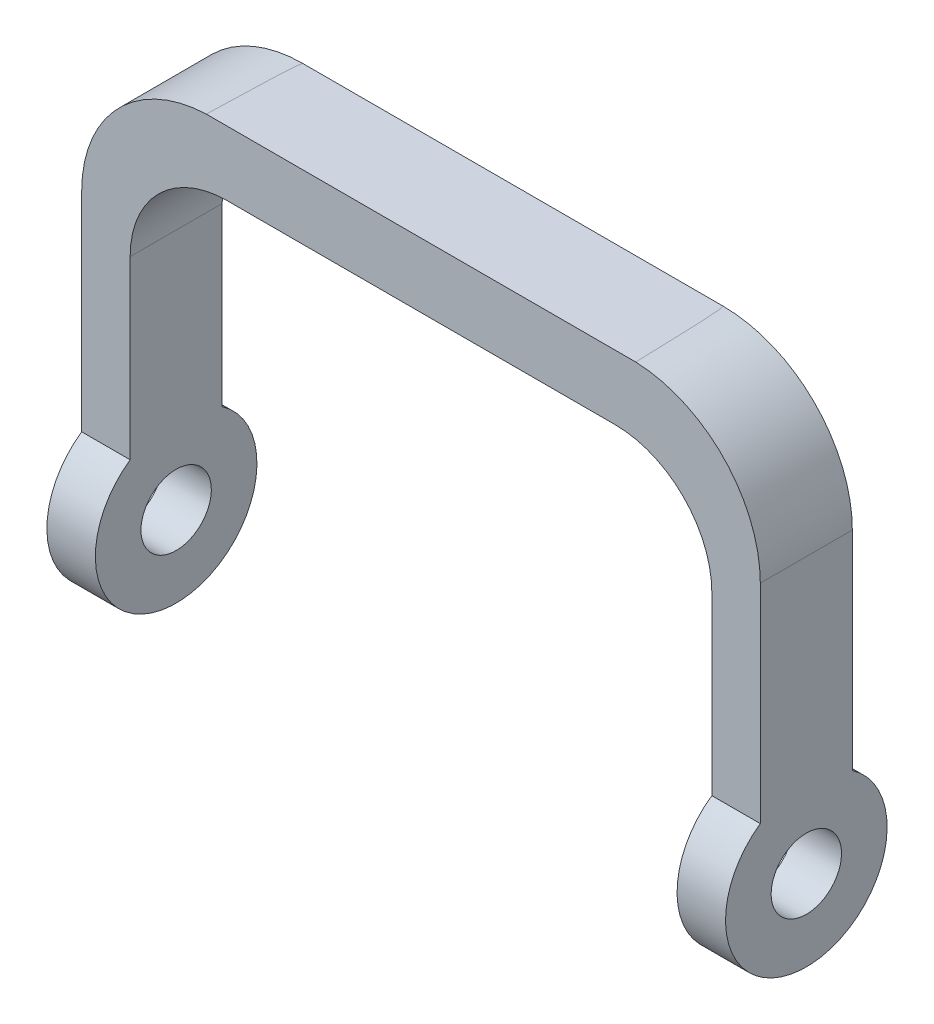
ISO-10303-21;
HEADER;
FILE_DESCRIPTION(('STEP AP214'),'2;1');
FILE_NAME('part.step','',(''),(''),'','','');
FILE_SCHEMA(('AUTOMOTIVE_DESIGN { 1 0 10303 214 1 1 1 1 }'));
ENDSEC;
DATA;
#1=APPLICATION_CONTEXT('core data for automotive mechanical design processes');
#2=APPLICATION_PROTOCOL_DEFINITION('international standard','automotive_design',2000,#1);
#3=PRODUCT_CONTEXT('',#1,'mechanical');
#4=PRODUCT('Part','Part','',(#3));
#5=PRODUCT_RELATED_PRODUCT_CATEGORY('part','',(#4));
#6=PRODUCT_DEFINITION_FORMATION('','',#4);
#7=PRODUCT_DEFINITION_CONTEXT('part definition',#1,'design');
#8=PRODUCT_DEFINITION('design','',#6,#7);
#9=PRODUCT_DEFINITION_SHAPE('','',#8);
#10=(LENGTH_UNIT() NAMED_UNIT(*) SI_UNIT(.MILLI.,.METRE.));
#11=(NAMED_UNIT(*) PLANE_ANGLE_UNIT() SI_UNIT($,.RADIAN.));
#12=(NAMED_UNIT(*) SI_UNIT($,.STERADIAN.) SOLID_ANGLE_UNIT());
#13=UNCERTAINTY_MEASURE_WITH_UNIT(LENGTH_MEASURE(1.E-05),#10,'distance_accuracy_value','');
#14=(GEOMETRIC_REPRESENTATION_CONTEXT(3) GLOBAL_UNCERTAINTY_ASSIGNED_CONTEXT((#13)) GLOBAL_UNIT_ASSIGNED_CONTEXT((#10,
#11,#12)) REPRESENTATION_CONTEXT('',''));
#15=CARTESIAN_POINT('',(0.,0.,0.));
#16=DIRECTION('',(0.,0.,1.));
#17=DIRECTION('',(1.,0.,0.));
#18=AXIS2_PLACEMENT_3D('',#15,#16,#17);
#19=CARTESIAN_POINT('',(180.,1.56754790290861E-13,0.));
#20=DIRECTION('',(1.,0.,0.));
#21=DIRECTION('',(0.,1.,0.));
#22=AXIS2_PLACEMENT_3D('',#19,#20,#21);
#23=PLANE('',#22);
#24=CARTESIAN_POINT('',(180.,50.0000000000001,50.));
#25=DIRECTION('',(1.,0.,0.));
#26=DIRECTION('',(0.,1.,0.));
#27=AXIS2_PLACEMENT_3D('',#24,#25,#26);
#28=CIRCLE('',#27,21.770153000844);
#29=CARTESIAN_POINT('',(180.,71.770153000844,50.));
#30=VERTEX_POINT('',#29);
#31=EDGE_CURVE('E184',#30,#30,#28,.T.);
#32=ORIENTED_EDGE('',*,*,#31,.T.);
#33=EDGE_LOOP('',(#32));
#34=FACE_BOUND('',#33,.T.);
#35=DIRECTION('',(0.,-1.,0.));
#36=VECTOR('',#35,1.);
#37=CARTESIAN_POINT('',(180.,1.46326116357652E-13,78.4697508896797));
#38=LINE('',#37,#36);
#39=CARTESIAN_POINT('',(180.,200.,78.4697508896797));
#40=VERTEX_POINT('',#39);
#41=CARTESIAN_POINT('',(180.,91.1032028469752,78.4697508896797));
#42=VERTEX_POINT('',#41);
#43=EDGE_CURVE('E178',#40,#42,#38,.T.);
#44=ORIENTED_EDGE('',*,*,#43,.F.);
#45=DIRECTION('',(0.,0.,1.));
#46=VECTOR('',#45,1.);
#47=CARTESIAN_POINT('',(180.,200.,0.));
#48=LINE('',#47,#46);
#49=CARTESIAN_POINT('',(180.,200.,21.5302491103203));
#50=VERTEX_POINT('',#49);
#51=EDGE_CURVE('E192',#50,#40,#48,.T.);
#52=ORIENTED_EDGE('',*,*,#51,.F.);
#53=DIRECTION('',(0.,1.,0.));
#54=VECTOR('',#53,1.);
#55=CARTESIAN_POINT('',(180.,1.53894121935247E-13,21.5302491103203));
#56=LINE('',#55,#54);
#57=CARTESIAN_POINT('',(180.,91.1032028469752,21.5302491103203));
#58=VERTEX_POINT('',#57);
#59=EDGE_CURVE('E167',#58,#50,#56,.T.);
#60=ORIENTED_EDGE('',*,*,#59,.F.);
#61=CARTESIAN_POINT('',(180.,50.0000000000001,50.));
#62=DIRECTION('',(1.,0.,0.));
#63=DIRECTION('',(0.,1.,0.));
#64=AXIS2_PLACEMENT_3D('',#61,#62,#63);
#65=CIRCLE('',#64,50.);
#66=EDGE_CURVE('E187',#42,#58,#65,.T.);
#67=ORIENTED_EDGE('',*,*,#66,.F.);
#68=EDGE_LOOP('',(#44,#52,#60,#67));
#69=FACE_BOUND('',#68,.T.);
#70=ADVANCED_FACE('F35',(#34,#69),#23,.F.);
#71=CARTESIAN_POINT('',(120.,260.,0.));
#72=DIRECTION('',(0.,1.,0.));
#73=DIRECTION('',(-1.,0.,0.));
#74=AXIS2_PLACEMENT_3D('',#71,#72,#73);
#75=PLANE('',#74);
#76=DIRECTION('',(1.,0.,0.));
#77=VECTOR('',#76,1.);
#78=CARTESIAN_POINT('',(120.,260.,78.4697508896797));
#79=LINE('',#78,#77);
#80=CARTESIAN_POINT('',(-120.,260.,78.4697508896797));
#81=VERTEX_POINT('',#80);
#82=CARTESIAN_POINT('',(120.,260.,78.4697508896797));
#83=VERTEX_POINT('',#82);
#84=EDGE_CURVE('E210',#81,#83,#79,.T.);
#85=ORIENTED_EDGE('',*,*,#84,.F.);
#86=DIRECTION('',(0.,0.,1.));
#87=VECTOR('',#86,1.);
#88=CARTESIAN_POINT('',(-120.,260.,0.));
#89=LINE('',#88,#87);
#90=CARTESIAN_POINT('',(-120.,260.,21.5302491103203));
#91=VERTEX_POINT('',#90);
#92=EDGE_CURVE('E199',#91,#81,#89,.T.);
#93=ORIENTED_EDGE('',*,*,#92,.F.);
#94=DIRECTION('',(-1.,0.,0.));
#95=VECTOR('',#94,1.);
#96=CARTESIAN_POINT('',(120.,260.,21.5302491103203));
#97=LINE('',#96,#95);
#98=CARTESIAN_POINT('',(120.,260.,21.5302491103203));
#99=VERTEX_POINT('',#98);
#100=EDGE_CURVE('E208',#99,#91,#97,.T.);
#101=ORIENTED_EDGE('',*,*,#100,.F.);
#102=DIRECTION('',(0.,0.,1.));
#103=VECTOR('',#102,1.);
#104=CARTESIAN_POINT('',(120.,260.,0.));
#105=LINE('',#104,#103);
#106=EDGE_CURVE('E191',#99,#83,#105,.T.);
#107=ORIENTED_EDGE('',*,*,#106,.T.);
#108=EDGE_LOOP('',(#85,#93,#101,#107));
#109=FACE_BOUND('',#108,.T.);
#110=ADVANCED_FACE('F235',(#109),#75,.F.);
#111=CARTESIAN_POINT('',(-120.,200.,0.));
#112=DIRECTION('',(0.,0.,1.));
#113=DIRECTION('',(1.,0.,0.));
#114=AXIS2_PLACEMENT_3D('',#111,#112,#113);
#115=CYLINDRICAL_SURFACE('',#114,59.9999999999999);
#116=CARTESIAN_POINT('',(-120.,200.,78.4697508896797));
#117=DIRECTION('',(0.,0.,1.));
#118=DIRECTION('',(0.,-1.,0.));
#119=AXIS2_PLACEMENT_3D('',#116,#117,#118);
#120=CIRCLE('',#119,59.9999999999999);
#121=CARTESIAN_POINT('',(-180.,200.,78.4697508896797));
#122=VERTEX_POINT('',#121);
#123=EDGE_CURVE('E173',#122,#81,#120,.F.);
#124=ORIENTED_EDGE('',*,*,#123,.F.);
#125=DIRECTION('',(0.,0.,1.));
#126=VECTOR('',#125,1.);
#127=CARTESIAN_POINT('',(-180.,200.,0.));
#128=LINE('',#127,#126);
#129=CARTESIAN_POINT('',(-180.,200.,21.5302491103203));
#130=VERTEX_POINT('',#129);
#131=EDGE_CURVE('E196',#130,#122,#128,.T.);
#132=ORIENTED_EDGE('',*,*,#131,.F.);
#133=CARTESIAN_POINT('',(-120.,200.,21.5302491103203));
#134=DIRECTION('',(0.,0.,-1.));
#135=DIRECTION('',(0.,1.,0.));
#136=AXIS2_PLACEMENT_3D('',#133,#134,#135);
#137=CIRCLE('',#136,59.9999999999999);
#138=EDGE_CURVE('E157',#91,#130,#137,.F.);
#139=ORIENTED_EDGE('',*,*,#138,.F.);
#140=ORIENTED_EDGE('',*,*,#92,.T.);
#141=EDGE_LOOP('',(#124,#132,#139,#140));
#142=FACE_BOUND('',#141,.T.);
#143=ADVANCED_FACE('F240',(#142),#115,.F.);
#144=CARTESIAN_POINT('',(-180.,200.,0.));
#145=DIRECTION('',(-1.,0.,0.));
#146=DIRECTION('',(0.,0.,1.));
#147=AXIS2_PLACEMENT_3D('',#144,#145,#146);
#148=PLANE('',#147);
#149=CARTESIAN_POINT('',(-180.,49.9999999999999,50.));
#150=DIRECTION('',(-1.,0.,0.));
#151=DIRECTION('',(0.,0.,1.));
#152=AXIS2_PLACEMENT_3D('',#149,#150,#151);
#153=CIRCLE('',#152,21.770153000844);
#154=CARTESIAN_POINT('',(-180.,49.9999999999999,71.770153000844));
#155=VERTEX_POINT('',#154);
#156=EDGE_CURVE('E183',#155,#155,#153,.T.);
#157=ORIENTED_EDGE('',*,*,#156,.T.);
#158=EDGE_LOOP('',(#157));
#159=FACE_BOUND('',#158,.T.);
#160=DIRECTION('',(0.,1.,0.));
#161=VECTOR('',#160,1.);
#162=CARTESIAN_POINT('',(-180.,200.,78.4697508896797));
#163=LINE('',#162,#161);
#164=CARTESIAN_POINT('',(-180.,91.103202846975,78.4697508896797));
#165=VERTEX_POINT('',#164);
#166=EDGE_CURVE('E175',#165,#122,#163,.T.);
#167=ORIENTED_EDGE('',*,*,#166,.F.);
#168=CARTESIAN_POINT('',(-180.,49.9999999999999,50.));
#169=DIRECTION('',(-1.,0.,0.));
#170=DIRECTION('',(0.,0.,1.));
#171=AXIS2_PLACEMENT_3D('',#168,#169,#170);
#172=CIRCLE('',#171,50.);
#173=CARTESIAN_POINT('',(-180.,91.103202846975,21.5302491103203));
#174=VERTEX_POINT('',#173);
#175=EDGE_CURVE('E43',#174,#165,#172,.T.);
#176=ORIENTED_EDGE('',*,*,#175,.F.);
#177=DIRECTION('',(0.,-1.,0.));
#178=VECTOR('',#177,1.);
#179=CARTESIAN_POINT('',(-180.,200.,21.5302491103203));
#180=LINE('',#179,#178);
#181=EDGE_CURVE('E163',#130,#174,#180,.T.);
#182=ORIENTED_EDGE('',*,*,#181,.F.);
#183=ORIENTED_EDGE('',*,*,#131,.T.);
#184=EDGE_LOOP('',(#167,#176,#182,#183));
#185=FACE_BOUND('',#184,.T.);
#186=ADVANCED_FACE('F215',(#159,#185),#148,.F.);
#187=CARTESIAN_POINT('',(120.,200.,0.));
#188=DIRECTION('',(0.,0.,1.));
#189=DIRECTION('',(1.,0.,0.));
#190=AXIS2_PLACEMENT_3D('',#187,#188,#189);
#191=CYLINDRICAL_SURFACE('',#190,59.9999999999999);
#192=CARTESIAN_POINT('',(120.,200.,78.4697508896797));
#193=DIRECTION('',(0.,0.,1.));
#194=DIRECTION('',(0.,-1.,0.));
#195=AXIS2_PLACEMENT_3D('',#192,#193,#194);
#196=CIRCLE('',#195,59.9999999999999);
#197=EDGE_CURVE('E58',#83,#40,#196,.F.);
#198=ORIENTED_EDGE('',*,*,#197,.F.);
#199=ORIENTED_EDGE('',*,*,#106,.F.);
#200=CARTESIAN_POINT('',(120.,200.,21.5302491103203));
#201=DIRECTION('',(0.,0.,-1.));
#202=DIRECTION('',(0.,1.,0.));
#203=AXIS2_PLACEMENT_3D('',#200,#201,#202);
#204=CIRCLE('',#203,59.9999999999999);
#205=EDGE_CURVE('E50',#50,#99,#204,.F.);
#206=ORIENTED_EDGE('',*,*,#205,.F.);
#207=ORIENTED_EDGE('',*,*,#51,.T.);
#208=EDGE_LOOP('',(#198,#199,#206,#207));
#209=FACE_BOUND('',#208,.T.);
#210=ADVANCED_FACE('F247',(#209),#191,.F.);
#211=CARTESIAN_POINT('',(-210.,299.947886102671,78.4697508896797));
#212=DIRECTION('',(0.,0.999999581158687,0.000915249938500952));
#213=DIRECTION('',(0.,-0.000915249938500952,0.999999581158687));
#214=AXIS2_PLACEMENT_3D('',#211,#212,#213);
#215=PLANE('',#214);
#216=CARTESIAN_POINT('',(130.,220.,87429.3115855653));
#217=DIRECTION('',(0.,0.999999581158687,0.000915249938500952));
#218=DIRECTION('',(0.,0.000915249938500952,-0.999999581158687));
#219=AXIS2_PLACEMENT_3D('',#216,#217,#218);
#220=ELLIPSE('',#219,87407.8179464601,80.);
#221=CARTESIAN_POINT('',(132.887127935229,299.947886102671,78.4697508896797));
#222=VERTEX_POINT('',#221);
#223=CARTESIAN_POINT('',(130.,300.,21.5302491103203));
#224=VERTEX_POINT('',#223);
#225=EDGE_CURVE('E189',#222,#224,#220,.T.);
#226=ORIENTED_EDGE('',*,*,#225,.T.);
#227=DIRECTION('',(1.,0.,0.));
#228=VECTOR('',#227,1.);
#229=CARTESIAN_POINT('',(-210.,300.,21.5302491103203));
#230=LINE('',#229,#228);
#231=CARTESIAN_POINT('',(-130.,300.,21.5302491103203));
#232=VERTEX_POINT('',#231);
#233=EDGE_CURVE('E271',#232,#224,#230,.T.);
#234=ORIENTED_EDGE('',*,*,#233,.F.);
#235=CARTESIAN_POINT('',(-130.,220.,87429.3115855652));
#236=DIRECTION('',(0.,0.999999581158687,0.000915249938500952));
#237=DIRECTION('',(0.,0.000915249938500952,-0.999999581158687));
#238=AXIS2_PLACEMENT_3D('',#235,#236,#237);
#239=ELLIPSE('',#238,87407.8179464601,80.);
#240=CARTESIAN_POINT('',(-132.887127935231,299.947886102671,78.4697508896797));
#241=VERTEX_POINT('',#240);
#242=EDGE_CURVE('E12',#232,#241,#239,.T.);
#243=ORIENTED_EDGE('',*,*,#242,.T.);
#244=DIRECTION('',(1.,0.,0.));
#245=VECTOR('',#244,1.);
#246=CARTESIAN_POINT('',(-210.,299.947886102671,78.4697508896797));
#247=LINE('',#246,#245);
#248=EDGE_CURVE('E161',#241,#222,#247,.T.);
#249=ORIENTED_EDGE('',*,*,#248,.T.);
#250=EDGE_LOOP('',(#226,#234,#243,#249));
#251=FACE_BOUND('',#250,.T.);
#252=ADVANCED_FACE('F253',(#251),#215,.T.);
#253=CARTESIAN_POINT('',(-210.,49.9999999999999,50.));
#254=DIRECTION('',(1.,0.,0.));
#255=DIRECTION('',(0.,1.,0.));
#256=AXIS2_PLACEMENT_3D('',#253,#254,#255);
#257=CYLINDRICAL_SURFACE('',#256,50.);
#258=ORIENTED_EDGE('',*,*,#66,.T.);
#259=DIRECTION('',(1.,0.,0.));
#260=VECTOR('',#259,1.);
#261=CARTESIAN_POINT('',(-210.,91.103202846975,21.5302491103203));
#262=LINE('',#261,#260);
#263=CARTESIAN_POINT('',(210.,91.1032028469752,21.5302491103203));
#264=VERTEX_POINT('',#263);
#265=EDGE_CURVE('E145',#58,#264,#262,.T.);
#266=ORIENTED_EDGE('',*,*,#265,.T.);
#267=CARTESIAN_POINT('',(210.,50.0000000000001,50.));
#268=DIRECTION('',(1.,0.,0.));
#269=DIRECTION('',(0.,1.,0.));
#270=AXIS2_PLACEMENT_3D('',#267,#268,#269);
#271=CIRCLE('',#270,50.);
#272=CARTESIAN_POINT('',(210.,91.1032028469752,78.4697508896797));
#273=VERTEX_POINT('',#272);
#274=EDGE_CURVE('E280',#273,#264,#271,.T.);
#275=ORIENTED_EDGE('',*,*,#274,.F.);
#276=DIRECTION('',(1.,0.,0.));
#277=VECTOR('',#276,1.);
#278=CARTESIAN_POINT('',(-210.,91.103202846975,78.4697508896797));
#279=LINE('',#278,#277);
#280=EDGE_CURVE('E146',#42,#273,#279,.T.);
#281=ORIENTED_EDGE('',*,*,#280,.F.);
#282=EDGE_LOOP('',(#258,#266,#275,#281));
#283=FACE_BOUND('',#282,.T.);
#284=ADVANCED_FACE('F302',(#283),#257,.T.);
#285=CARTESIAN_POINT('',(-210.,49.9999999999999,50.));
#286=DIRECTION('',(1.,0.,0.));
#287=DIRECTION('',(0.,1.,0.));
#288=AXIS2_PLACEMENT_3D('',#285,#286,#287);
#289=CIRCLE('',#288,50.);
#290=CARTESIAN_POINT('',(-210.,91.103202846975,78.4697508896797));
#291=VERTEX_POINT('',#290);
#292=CARTESIAN_POINT('',(-210.,91.103202846975,21.5302491103203));
#293=VERTEX_POINT('',#292);
#294=EDGE_CURVE('E123',#291,#293,#289,.T.);
#295=ORIENTED_EDGE('',*,*,#294,.T.);
#296=EDGE_CURVE('E149',#293,#174,#262,.T.);
#297=ORIENTED_EDGE('',*,*,#296,.T.);
#298=ORIENTED_EDGE('',*,*,#175,.T.);
#299=EDGE_CURVE('E137',#291,#165,#279,.T.);
#300=ORIENTED_EDGE('',*,*,#299,.F.);
#301=EDGE_LOOP('',(#295,#297,#298,#300));
#302=FACE_BOUND('',#301,.T.);
#303=ADVANCED_FACE('F144',(#302),#257,.T.);
#304=CARTESIAN_POINT('',(-210.,299.947886102671,78.4697508896797));
#305=DIRECTION('',(0.,0.,1.));
#306=DIRECTION('',(0.,-1.,0.));
#307=AXIS2_PLACEMENT_3D('',#304,#305,#306);
#308=PLANE('',#307);
#309=CARTESIAN_POINT('',(130.,220.,78.4697508896797));
#310=DIRECTION('',(0.,0.,1.));
#311=DIRECTION('',(0.,-1.,0.));
#312=AXIS2_PLACEMENT_3D('',#309,#310,#311);
#313=CIRCLE('',#312,80.);
#314=CARTESIAN_POINT('',(210.,220.,78.4697508896797));
#315=VERTEX_POINT('',#314);
#316=EDGE_CURVE('E181',#315,#222,#313,.T.);
#317=ORIENTED_EDGE('',*,*,#316,.T.);
#318=ORIENTED_EDGE('',*,*,#248,.F.);
#319=CARTESIAN_POINT('',(-130.,220.,78.4697508896797));
#320=DIRECTION('',(0.,0.,1.));
#321=DIRECTION('',(0.,-1.,0.));
#322=AXIS2_PLACEMENT_3D('',#319,#320,#321);
#323=CIRCLE('',#322,80.);
#324=CARTESIAN_POINT('',(-210.,220.,78.4697508896797));
#325=VERTEX_POINT('',#324);
#326=EDGE_CURVE('E141',#241,#325,#323,.T.);
#327=ORIENTED_EDGE('',*,*,#326,.T.);
#328=DIRECTION('',(0.,-1.,0.));
#329=VECTOR('',#328,1.);
#330=CARTESIAN_POINT('',(-210.,299.947886102671,78.4697508896797));
#331=LINE('',#330,#329);
#332=EDGE_CURVE('E127',#325,#291,#331,.T.);
#333=ORIENTED_EDGE('',*,*,#332,.T.);
#334=ORIENTED_EDGE('',*,*,#299,.T.);
#335=ORIENTED_EDGE('',*,*,#166,.T.);
#336=ORIENTED_EDGE('',*,*,#123,.T.);
#337=ORIENTED_EDGE('',*,*,#84,.T.);
#338=ORIENTED_EDGE('',*,*,#197,.T.);
#339=ORIENTED_EDGE('',*,*,#43,.T.);
#340=ORIENTED_EDGE('',*,*,#280,.T.);
#341=DIRECTION('',(0.,-1.,0.));
#342=VECTOR('',#341,1.);
#343=CARTESIAN_POINT('',(210.,299.947886102671,78.4697508896797));
#344=LINE('',#343,#342);
#345=EDGE_CURVE('E282',#315,#273,#344,.T.);
#346=ORIENTED_EDGE('',*,*,#345,.F.);
#347=EDGE_LOOP('',(#317,#318,#327,#333,#334,#335,#336,#337,#338,#339,#340,#346));
#348=FACE_BOUND('',#347,.T.);
#349=ADVANCED_FACE('F136',(#348),#308,.T.);
#350=CARTESIAN_POINT('',(-210.,300.,21.5302491103203));
#351=DIRECTION('',(0.,0.,-1.));
#352=DIRECTION('',(0.,1.,0.));
#353=AXIS2_PLACEMENT_3D('',#350,#351,#352);
#354=PLANE('',#353);
#355=CARTESIAN_POINT('',(130.,220.,21.5302491103203));
#356=DIRECTION('',(0.,0.,-1.));
#357=DIRECTION('',(0.,1.,0.));
#358=AXIS2_PLACEMENT_3D('',#355,#356,#357);
#359=CIRCLE('',#358,80.);
#360=CARTESIAN_POINT('',(210.,220.,21.5302491103203));
#361=VERTEX_POINT('',#360);
#362=EDGE_CURVE('E171',#224,#361,#359,.T.);
#363=ORIENTED_EDGE('',*,*,#362,.T.);
#364=DIRECTION('',(0.,1.,0.));
#365=VECTOR('',#364,1.);
#366=CARTESIAN_POINT('',(210.,300.,21.5302491103203));
#367=LINE('',#366,#365);
#368=EDGE_CURVE('E142',#264,#361,#367,.T.);
#369=ORIENTED_EDGE('',*,*,#368,.F.);
#370=ORIENTED_EDGE('',*,*,#265,.F.);
#371=ORIENTED_EDGE('',*,*,#59,.T.);
#372=ORIENTED_EDGE('',*,*,#205,.T.);
#373=ORIENTED_EDGE('',*,*,#100,.T.);
#374=ORIENTED_EDGE('',*,*,#138,.T.);
#375=ORIENTED_EDGE('',*,*,#181,.T.);
#376=ORIENTED_EDGE('',*,*,#296,.F.);
#377=DIRECTION('',(0.,1.,0.));
#378=VECTOR('',#377,1.);
#379=CARTESIAN_POINT('',(-210.,300.,21.5302491103203));
#380=LINE('',#379,#378);
#381=CARTESIAN_POINT('',(-210.,220.,21.5302491103203));
#382=VERTEX_POINT('',#381);
#383=EDGE_CURVE('E129',#293,#382,#380,.T.);
#384=ORIENTED_EDGE('',*,*,#383,.T.);
#385=CARTESIAN_POINT('',(-130.,220.,21.5302491103203));
#386=DIRECTION('',(0.,0.,-1.));
#387=DIRECTION('',(0.,1.,0.));
#388=AXIS2_PLACEMENT_3D('',#385,#386,#387);
#389=CIRCLE('',#388,80.);
#390=EDGE_CURVE('E169',#382,#232,#389,.T.);
#391=ORIENTED_EDGE('',*,*,#390,.T.);
#392=ORIENTED_EDGE('',*,*,#233,.T.);
#393=EDGE_LOOP('',(#363,#369,#370,#371,#372,#373,#374,#375,#376,#384,#391,#392));
#394=FACE_BOUND('',#393,.T.);
#395=ADVANCED_FACE('F221',(#394),#354,.T.);
#396=CARTESIAN_POINT('',(-210.,49.9999999999999,50.));
#397=DIRECTION('',(1.,0.,0.));
#398=DIRECTION('',(0.,1.,0.));
#399=AXIS2_PLACEMENT_3D('',#396,#397,#398);
#400=CYLINDRICAL_SURFACE('',#399,21.770153000844);
#401=CARTESIAN_POINT('',(-210.,49.9999999999999,50.));
#402=DIRECTION('',(1.,0.,0.));
#403=DIRECTION('',(0.,1.,0.));
#404=AXIS2_PLACEMENT_3D('',#401,#402,#403);
#405=CIRCLE('',#404,21.770153000844);
#406=CARTESIAN_POINT('',(-210.,71.7701530008439,50.));
#407=VERTEX_POINT('',#406);
#408=EDGE_CURVE('E154',#407,#407,#405,.T.);
#409=ORIENTED_EDGE('',*,*,#408,.F.);
#410=EDGE_LOOP('',(#409));
#411=FACE_BOUND('',#410,.T.);
#412=ORIENTED_EDGE('',*,*,#156,.F.);
#413=EDGE_LOOP('',(#412));
#414=FACE_BOUND('',#413,.T.);
#415=ADVANCED_FACE('F218',(#411,#414),#400,.F.);
#416=CARTESIAN_POINT('',(210.,50.0000000000001,50.));
#417=DIRECTION('',(1.,0.,0.));
#418=DIRECTION('',(0.,1.,0.));
#419=AXIS2_PLACEMENT_3D('',#416,#417,#418);
#420=CIRCLE('',#419,21.770153000844);
#421=CARTESIAN_POINT('',(210.,71.770153000844,50.));
#422=VERTEX_POINT('',#421);
#423=EDGE_CURVE('E158',#422,#422,#420,.T.);
#424=ORIENTED_EDGE('',*,*,#423,.T.);
#425=EDGE_LOOP('',(#424));
#426=FACE_BOUND('',#425,.T.);
#427=ORIENTED_EDGE('',*,*,#31,.F.);
#428=EDGE_LOOP('',(#427));
#429=FACE_BOUND('',#428,.T.);
#430=ADVANCED_FACE('F220',(#426,#429),#400,.F.);
#431=CARTESIAN_POINT('',(210.,220.,100.));
#432=DIRECTION('',(-1.,0.,0.));
#433=DIRECTION('',(0.,-1.,0.));
#434=AXIS2_PLACEMENT_3D('',#431,#432,#433);
#435=PLANE('',#434);
#436=ORIENTED_EDGE('',*,*,#423,.F.);
#437=EDGE_LOOP('',(#436));
#438=FACE_BOUND('',#437,.T.);
#439=ORIENTED_EDGE('',*,*,#345,.T.);
#440=ORIENTED_EDGE('',*,*,#274,.T.);
#441=ORIENTED_EDGE('',*,*,#368,.T.);
#442=DIRECTION('',(0.,0.,-1.));
#443=VECTOR('',#442,1.);
#444=CARTESIAN_POINT('',(210.,220.,100.));
#445=LINE('',#444,#443);
#446=EDGE_CURVE('E195',#315,#361,#445,.T.);
#447=ORIENTED_EDGE('',*,*,#446,.F.);
#448=EDGE_LOOP('',(#439,#440,#441,#447));
#449=FACE_BOUND('',#448,.T.);
#450=ADVANCED_FACE('F228',(#438,#449),#435,.F.);
#451=CARTESIAN_POINT('',(130.,220.,100.));
#452=DIRECTION('',(0.,0.,-1.));
#453=DIRECTION('',(-1.,0.,0.));
#454=AXIS2_PLACEMENT_3D('',#451,#452,#453);
#455=CYLINDRICAL_SURFACE('',#454,80.);
#456=ORIENTED_EDGE('',*,*,#316,.F.);
#457=ORIENTED_EDGE('',*,*,#446,.T.);
#458=ORIENTED_EDGE('',*,*,#362,.F.);
#459=ORIENTED_EDGE('',*,*,#225,.F.);
#460=EDGE_LOOP('',(#456,#457,#458,#459));
#461=FACE_BOUND('',#460,.T.);
#462=ADVANCED_FACE('F37',(#461),#455,.T.);
#463=CARTESIAN_POINT('',(-130.,220.,100.));
#464=DIRECTION('',(0.,0.,-1.));
#465=DIRECTION('',(-1.,0.,0.));
#466=AXIS2_PLACEMENT_3D('',#463,#464,#465);
#467=CYLINDRICAL_SURFACE('',#466,80.);
#468=ORIENTED_EDGE('',*,*,#326,.F.);
#469=ORIENTED_EDGE('',*,*,#242,.F.);
#470=ORIENTED_EDGE('',*,*,#390,.F.);
#471=DIRECTION('',(0.,0.,-1.));
#472=VECTOR('',#471,1.);
#473=CARTESIAN_POINT('',(-210.,220.,100.));
#474=LINE('',#473,#472);
#475=EDGE_CURVE('E206',#325,#382,#474,.T.);
#476=ORIENTED_EDGE('',*,*,#475,.F.);
#477=EDGE_LOOP('',(#468,#469,#470,#476));
#478=FACE_BOUND('',#477,.T.);
#479=ADVANCED_FACE('F259',(#478),#467,.T.);
#480=CARTESIAN_POINT('',(-210.,0.,100.));
#481=DIRECTION('',(1.,0.,0.));
#482=DIRECTION('',(0.,1.,0.));
#483=AXIS2_PLACEMENT_3D('',#480,#481,#482);
#484=PLANE('',#483);
#485=ORIENTED_EDGE('',*,*,#408,.T.);
#486=EDGE_LOOP('',(#485));
#487=FACE_BOUND('',#486,.T.);
#488=ORIENTED_EDGE('',*,*,#332,.F.);
#489=ORIENTED_EDGE('',*,*,#475,.T.);
#490=ORIENTED_EDGE('',*,*,#383,.F.);
#491=ORIENTED_EDGE('',*,*,#294,.F.);
#492=EDGE_LOOP('',(#488,#489,#490,#491));
#493=FACE_BOUND('',#492,.T.);
#494=ADVANCED_FACE('F125',(#487,#493),#484,.F.);
#495=CLOSED_SHELL('',(#70,#110,#143,#186,#210,#252,#284,#303,#349,#395,#415,#430,#450,#462,#479,#494));
#496=MANIFOLD_SOLID_BREP('B2',#495);
#497=ADVANCED_BREP_SHAPE_REPRESENTATION('',(#18,#496),#14);
#498=SHAPE_DEFINITION_REPRESENTATION(#9,#497);
ENDSEC;
END-ISO-10303-21;
